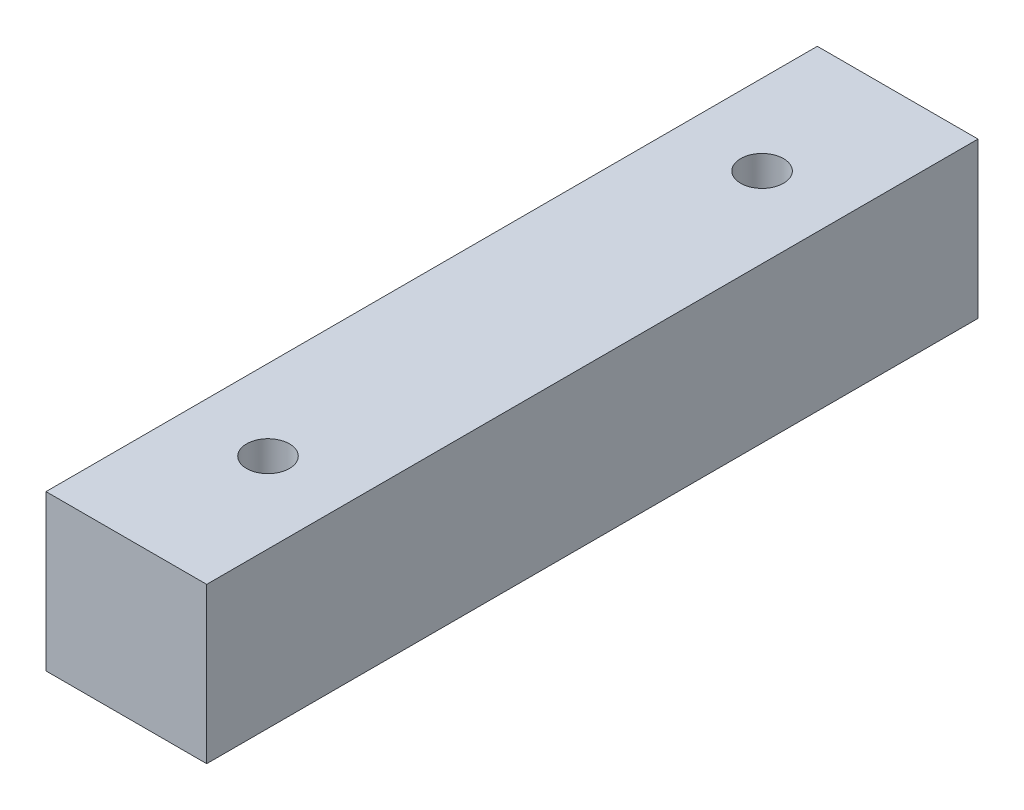
ISO-10303-21;
HEADER;
FILE_DESCRIPTION(('STEP AP214'),'2;1');
FILE_NAME('part.step','',(''),(''),'','','');
FILE_SCHEMA(('AUTOMOTIVE_DESIGN { 1 0 10303 214 1 1 1 1 }'));
ENDSEC;
DATA;
#1=APPLICATION_CONTEXT('core data for automotive mechanical design processes');
#2=APPLICATION_PROTOCOL_DEFINITION('international standard','automotive_design',2000,#1);
#3=PRODUCT_CONTEXT('',#1,'mechanical');
#4=PRODUCT('Part','Part','',(#3));
#5=PRODUCT_RELATED_PRODUCT_CATEGORY('part','',(#4));
#6=PRODUCT_DEFINITION_FORMATION('','',#4);
#7=PRODUCT_DEFINITION_CONTEXT('part definition',#1,'design');
#8=PRODUCT_DEFINITION('design','',#6,#7);
#9=PRODUCT_DEFINITION_SHAPE('','',#8);
#10=(LENGTH_UNIT() NAMED_UNIT(*) SI_UNIT(.MILLI.,.METRE.));
#11=(NAMED_UNIT(*) PLANE_ANGLE_UNIT() SI_UNIT($,.RADIAN.));
#12=(NAMED_UNIT(*) SI_UNIT($,.STERADIAN.) SOLID_ANGLE_UNIT());
#13=UNCERTAINTY_MEASURE_WITH_UNIT(LENGTH_MEASURE(1.E-05),#10,'distance_accuracy_value','');
#14=(GEOMETRIC_REPRESENTATION_CONTEXT(3) GLOBAL_UNCERTAINTY_ASSIGNED_CONTEXT((#13)) GLOBAL_UNIT_ASSIGNED_CONTEXT((#10,
#11,#12)) REPRESENTATION_CONTEXT('',''));
#15=CARTESIAN_POINT('',(0.,0.,0.));
#16=DIRECTION('',(0.,0.,1.));
#17=DIRECTION('',(1.,0.,0.));
#18=AXIS2_PLACEMENT_3D('',#15,#16,#17);
#19=CARTESIAN_POINT('',(1500.,1350.,6600.));
#20=DIRECTION('',(0.,-1.,0.));
#21=DIRECTION('',(0.,0.,-1.));
#22=AXIS2_PLACEMENT_3D('',#19,#20,#21);
#23=PLANE('',#22);
#24=CARTESIAN_POINT('',(0.,1350.,-5068.70348609479));
#25=DIRECTION('',(0.,-1.,0.));
#26=DIRECTION('',(0.,0.,-1.));
#27=AXIS2_PLACEMENT_3D('',#24,#25,#26);
#28=CIRCLE('',#27,400.);
#29=CARTESIAN_POINT('',(0.,1350.,-5468.70348609479));
#30=VERTEX_POINT('',#29);
#31=EDGE_CURVE('E44',#30,#30,#28,.T.);
#32=ORIENTED_EDGE('',*,*,#31,.T.);
#33=EDGE_LOOP('',(#32));
#34=FACE_BOUND('',#33,.T.);
#35=CARTESIAN_POINT('',(0.,1350.,4155.24));
#36=DIRECTION('',(0.,-1.,0.));
#37=DIRECTION('',(0.,0.,-1.));
#38=AXIS2_PLACEMENT_3D('',#35,#36,#37);
#39=CIRCLE('',#38,400.);
#40=CARTESIAN_POINT('',(0.,1350.,3755.24));
#41=VERTEX_POINT('',#40);
#42=EDGE_CURVE('E130',#41,#41,#39,.T.);
#43=ORIENTED_EDGE('',*,*,#42,.T.);
#44=EDGE_LOOP('',(#43));
#45=FACE_BOUND('',#44,.T.);
#46=DIRECTION('',(0.,0.,1.));
#47=VECTOR('',#46,1.);
#48=CARTESIAN_POINT('',(-1500.,1350.,6600.));
#49=LINE('',#48,#47);
#50=CARTESIAN_POINT('',(-1500.,1350.,-7600.));
#51=VERTEX_POINT('',#50);
#52=CARTESIAN_POINT('',(-1500.,1350.,6800.));
#53=VERTEX_POINT('',#52);
#54=EDGE_CURVE('E50',#51,#53,#49,.T.);
#55=ORIENTED_EDGE('',*,*,#54,.T.);
#56=DIRECTION('',(-1.,0.,0.));
#57=VECTOR('',#56,1.);
#58=CARTESIAN_POINT('',(1500.,1350.,6800.));
#59=LINE('',#58,#57);
#60=CARTESIAN_POINT('',(1500.,1350.,6800.));
#61=VERTEX_POINT('',#60);
#62=EDGE_CURVE('E112',#61,#53,#59,.T.);
#63=ORIENTED_EDGE('',*,*,#62,.F.);
#64=DIRECTION('',(0.,0.,1.));
#65=VECTOR('',#64,1.);
#66=CARTESIAN_POINT('',(1500.,1350.,6600.));
#67=LINE('',#66,#65);
#68=CARTESIAN_POINT('',(1500.,1350.,-7600.));
#69=VERTEX_POINT('',#68);
#70=EDGE_CURVE('E11',#69,#61,#67,.T.);
#71=ORIENTED_EDGE('',*,*,#70,.F.);
#72=DIRECTION('',(1.,0.,0.));
#73=VECTOR('',#72,1.);
#74=CARTESIAN_POINT('',(-1500.,1350.,-7600.));
#75=LINE('',#74,#73);
#76=EDGE_CURVE('E100',#51,#69,#75,.T.);
#77=ORIENTED_EDGE('',*,*,#76,.F.);
#78=EDGE_LOOP('',(#55,#63,#71,#77));
#79=FACE_BOUND('',#78,.T.);
#80=ADVANCED_FACE('F41',(#34,#45,#79),#23,.F.);
#81=CARTESIAN_POINT('',(1500.,0.,0.));
#82=DIRECTION('',(1.,0.,0.));
#83=DIRECTION('',(0.,0.,-1.));
#84=AXIS2_PLACEMENT_3D('',#81,#82,#83);
#85=PLANE('',#84);
#86=DIRECTION('',(0.,0.,1.));
#87=VECTOR('',#86,1.);
#88=CARTESIAN_POINT('',(1500.,-1550.,-6600.));
#89=LINE('',#88,#87);
#90=CARTESIAN_POINT('',(1500.,-1550.,-7600.));
#91=VERTEX_POINT('',#90);
#92=CARTESIAN_POINT('',(1500.,-1550.,6800.));
#93=VERTEX_POINT('',#92);
#94=EDGE_CURVE('E64',#91,#93,#89,.T.);
#95=ORIENTED_EDGE('',*,*,#94,.F.);
#96=DIRECTION('',(0.,-1.,0.));
#97=VECTOR('',#96,1.);
#98=CARTESIAN_POINT('',(1500.,1350.,-7600.));
#99=LINE('',#98,#97);
#100=EDGE_CURVE('E104',#69,#91,#99,.T.);
#101=ORIENTED_EDGE('',*,*,#100,.F.);
#102=ORIENTED_EDGE('',*,*,#70,.T.);
#103=DIRECTION('',(0.,1.,0.));
#104=VECTOR('',#103,1.);
#105=CARTESIAN_POINT('',(1500.,-1550.,6800.));
#106=LINE('',#105,#104);
#107=EDGE_CURVE('E91',#93,#61,#106,.T.);
#108=ORIENTED_EDGE('',*,*,#107,.F.);
#109=EDGE_LOOP('',(#95,#101,#102,#108));
#110=FACE_BOUND('',#109,.T.);
#111=ADVANCED_FACE('F156',(#110),#85,.T.);
#112=CARTESIAN_POINT('',(-1500.,0.,0.));
#113=DIRECTION('',(1.,0.,0.));
#114=DIRECTION('',(0.,0.,-1.));
#115=AXIS2_PLACEMENT_3D('',#112,#113,#114);
#116=PLANE('',#115);
#117=ORIENTED_EDGE('',*,*,#54,.F.);
#118=DIRECTION('',(0.,1.,0.));
#119=VECTOR('',#118,1.);
#120=CARTESIAN_POINT('',(-1500.,-1550.,-7600.));
#121=LINE('',#120,#119);
#122=CARTESIAN_POINT('',(-1500.,-1550.,-7600.));
#123=VERTEX_POINT('',#122);
#124=EDGE_CURVE('E94',#123,#51,#121,.T.);
#125=ORIENTED_EDGE('',*,*,#124,.F.);
#126=DIRECTION('',(0.,0.,-1.));
#127=VECTOR('',#126,1.);
#128=CARTESIAN_POINT('',(-1500.,-1550.,6600.));
#129=LINE('',#128,#127);
#130=CARTESIAN_POINT('',(-1500.,-1550.,6800.));
#131=VERTEX_POINT('',#130);
#132=EDGE_CURVE('E81',#131,#123,#129,.T.);
#133=ORIENTED_EDGE('',*,*,#132,.F.);
#134=DIRECTION('',(0.,-1.,0.));
#135=VECTOR('',#134,1.);
#136=CARTESIAN_POINT('',(-1500.,1350.,6800.));
#137=LINE('',#136,#135);
#138=EDGE_CURVE('E116',#53,#131,#137,.T.);
#139=ORIENTED_EDGE('',*,*,#138,.F.);
#140=EDGE_LOOP('',(#117,#125,#133,#139));
#141=FACE_BOUND('',#140,.T.);
#142=ADVANCED_FACE('F95',(#141),#116,.F.);
#143=CARTESIAN_POINT('',(0.,-739.614296905602,-5068.70348609479));
#144=DIRECTION('',(0.,1.,0.));
#145=DIRECTION('',(0.,0.,1.));
#146=AXIS2_PLACEMENT_3D('',#143,#144,#145);
#147=CYLINDRICAL_SURFACE('',#146,400.);
#148=CARTESIAN_POINT('',(0.,-299.514296905601,-5068.70348609479));
#149=DIRECTION('',(0.,0.707106781186548,-0.707106781186547));
#150=DIRECTION('',(0.,-0.707106781186547,-0.707106781186548));
#151=AXIS2_PLACEMENT_3D('',#148,#149,#150);
#152=ELLIPSE('',#151,565.685424949238,400.);
#153=CARTESIAN_POINT('',(0.,-699.514296905601,-5468.70348609479));
#154=VERTEX_POINT('',#153);
#155=EDGE_CURVE('E125',#154,#154,#152,.F.);
#156=ORIENTED_EDGE('',*,*,#155,.T.);
#157=EDGE_LOOP('',(#156));
#158=FACE_BOUND('',#157,.T.);
#159=ORIENTED_EDGE('',*,*,#31,.F.);
#160=EDGE_LOOP('',(#159));
#161=FACE_BOUND('',#160,.T.);
#162=ADVANCED_FACE('F144',(#158,#161),#147,.F.);
#163=CARTESIAN_POINT('',(0.,1658.84841363102,4155.24));
#164=DIRECTION('',(0.,-1.,0.));
#165=DIRECTION('',(0.,0.,-1.));
#166=AXIS2_PLACEMENT_3D('',#163,#164,#165);
#167=CYLINDRICAL_SURFACE('',#166,400.);
#168=CARTESIAN_POINT('',(0.,-299.514296905601,4155.24));
#169=DIRECTION('',(0.,-0.707106781186547,-0.707106781186548));
#170=DIRECTION('',(0.,-0.707106781186548,0.707106781186547));
#171=AXIS2_PLACEMENT_3D('',#168,#169,#170);
#172=ELLIPSE('',#171,565.685424949238,400.);
#173=CARTESIAN_POINT('',(0.,-699.514296905601,4555.24));
#174=VERTEX_POINT('',#173);
#175=EDGE_CURVE('E126',#174,#174,#172,.F.);
#176=ORIENTED_EDGE('',*,*,#175,.F.);
#177=EDGE_LOOP('',(#176));
#178=FACE_BOUND('',#177,.T.);
#179=ORIENTED_EDGE('',*,*,#42,.F.);
#180=EDGE_LOOP('',(#179));
#181=FACE_BOUND('',#180,.T.);
#182=ADVANCED_FACE('F146',(#178,#181),#167,.F.);
#183=CARTESIAN_POINT('',(0.,-299.514296905601,4595.34));
#184=DIRECTION('',(0.,0.,-1.));
#185=DIRECTION('',(-1.,0.,0.));
#186=AXIS2_PLACEMENT_3D('',#183,#184,#185);
#187=CYLINDRICAL_SURFACE('',#186,400.);
#188=ORIENTED_EDGE('',*,*,#175,.T.);
#189=EDGE_LOOP('',(#188));
#190=FACE_BOUND('',#189,.T.);
#191=ORIENTED_EDGE('',*,*,#155,.F.);
#192=EDGE_LOOP('',(#191));
#193=FACE_BOUND('',#192,.T.);
#194=ADVANCED_FACE('F152',(#190,#193),#187,.F.);
#195=CARTESIAN_POINT('',(0.,-1550.,0.));
#196=DIRECTION('',(0.,-1.,0.));
#197=DIRECTION('',(0.,0.,-1.));
#198=AXIS2_PLACEMENT_3D('',#195,#196,#197);
#199=PLANE('',#198);
#200=ORIENTED_EDGE('',*,*,#94,.T.);
#201=DIRECTION('',(1.,0.,0.));
#202=VECTOR('',#201,1.);
#203=CARTESIAN_POINT('',(-1500.,-1550.,6800.));
#204=LINE('',#203,#202);
#205=EDGE_CURVE('E86',#131,#93,#204,.T.);
#206=ORIENTED_EDGE('',*,*,#205,.F.);
#207=ORIENTED_EDGE('',*,*,#132,.T.);
#208=DIRECTION('',(-1.,0.,0.));
#209=VECTOR('',#208,1.);
#210=CARTESIAN_POINT('',(1500.,-1550.,-7600.));
#211=LINE('',#210,#209);
#212=EDGE_CURVE('E85',#91,#123,#211,.T.);
#213=ORIENTED_EDGE('',*,*,#212,.F.);
#214=EDGE_LOOP('',(#200,#206,#207,#213));
#215=FACE_BOUND('',#214,.T.);
#216=ADVANCED_FACE('F83',(#215),#199,.T.);
#217=CARTESIAN_POINT('',(0.,0.,6800.));
#218=DIRECTION('',(0.,0.,1.));
#219=DIRECTION('',(1.,0.,0.));
#220=AXIS2_PLACEMENT_3D('',#217,#218,#219);
#221=PLANE('',#220);
#222=ORIENTED_EDGE('',*,*,#62,.T.);
#223=ORIENTED_EDGE('',*,*,#138,.T.);
#224=ORIENTED_EDGE('',*,*,#205,.T.);
#225=ORIENTED_EDGE('',*,*,#107,.T.);
#226=EDGE_LOOP('',(#222,#223,#224,#225));
#227=FACE_BOUND('',#226,.T.);
#228=ADVANCED_FACE('F168',(#227),#221,.T.);
#229=CARTESIAN_POINT('',(0.,0.,-7600.));
#230=DIRECTION('',(0.,0.,-1.));
#231=DIRECTION('',(-1.,0.,0.));
#232=AXIS2_PLACEMENT_3D('',#229,#230,#231);
#233=PLANE('',#232);
#234=ORIENTED_EDGE('',*,*,#212,.T.);
#235=ORIENTED_EDGE('',*,*,#124,.T.);
#236=ORIENTED_EDGE('',*,*,#76,.T.);
#237=ORIENTED_EDGE('',*,*,#100,.T.);
#238=EDGE_LOOP('',(#234,#235,#236,#237));
#239=FACE_BOUND('',#238,.T.);
#240=ADVANCED_FACE('F103',(#239),#233,.T.);
#241=CLOSED_SHELL('',(#80,#111,#142,#162,#182,#194,#216,#228,#240));
#242=MANIFOLD_SOLID_BREP('B2',#241);
#243=ADVANCED_BREP_SHAPE_REPRESENTATION('',(#18,#242),#14);
#244=SHAPE_DEFINITION_REPRESENTATION(#9,#243);
ENDSEC;
END-ISO-10303-21;
